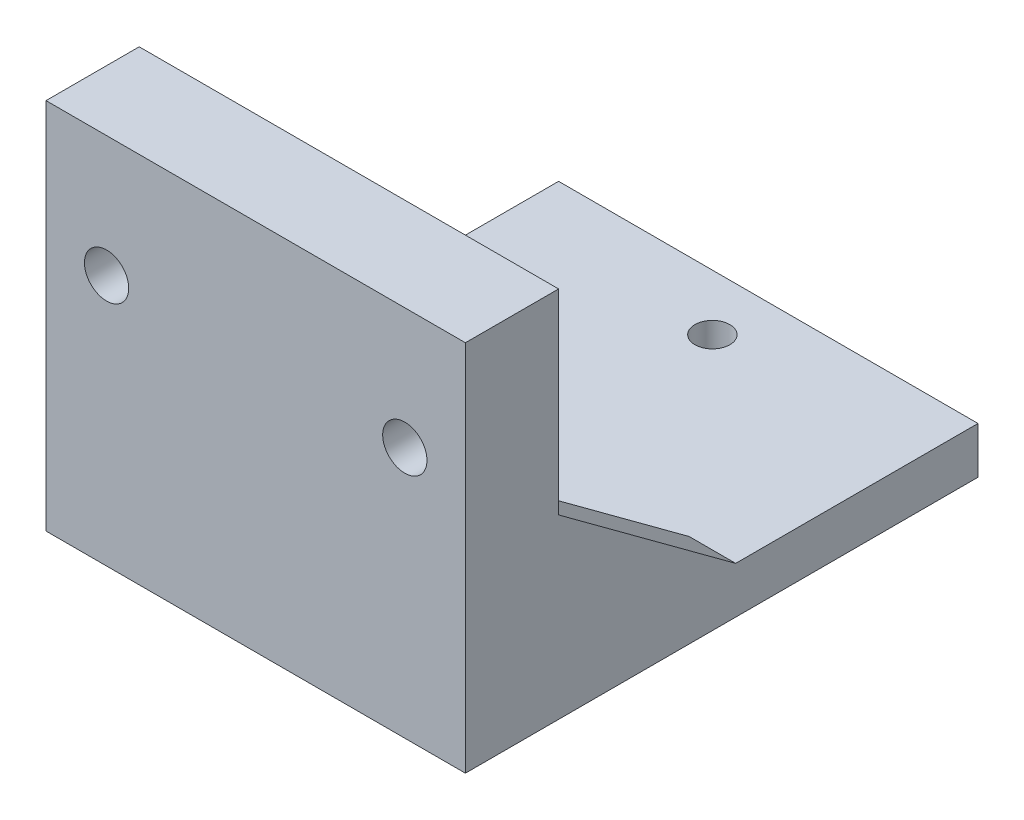
ISO-10303-21;
HEADER;
FILE_DESCRIPTION(('STEP AP214'),'2;1');
FILE_NAME('part.step','',(''),(''),'','','');
FILE_SCHEMA(('AUTOMOTIVE_DESIGN { 1 0 10303 214 1 1 1 1 }'));
ENDSEC;
DATA;
#1=APPLICATION_CONTEXT('core data for automotive mechanical design processes');
#2=APPLICATION_PROTOCOL_DEFINITION('international standard','automotive_design',2000,#1);
#3=PRODUCT_CONTEXT('',#1,'mechanical');
#4=PRODUCT('Part','Part','',(#3));
#5=PRODUCT_RELATED_PRODUCT_CATEGORY('part','',(#4));
#6=PRODUCT_DEFINITION_FORMATION('','',#4);
#7=PRODUCT_DEFINITION_CONTEXT('part definition',#1,'design');
#8=PRODUCT_DEFINITION('design','',#6,#7);
#9=PRODUCT_DEFINITION_SHAPE('','',#8);
#10=(LENGTH_UNIT() NAMED_UNIT(*) SI_UNIT(.MILLI.,.METRE.));
#11=(NAMED_UNIT(*) PLANE_ANGLE_UNIT() SI_UNIT($,.RADIAN.));
#12=(NAMED_UNIT(*) SI_UNIT($,.STERADIAN.) SOLID_ANGLE_UNIT());
#13=UNCERTAINTY_MEASURE_WITH_UNIT(LENGTH_MEASURE(1.E-05),#10,'distance_accuracy_value','');
#14=(GEOMETRIC_REPRESENTATION_CONTEXT(3) GLOBAL_UNCERTAINTY_ASSIGNED_CONTEXT((#13)) GLOBAL_UNIT_ASSIGNED_CONTEXT((#10,
#11,#12)) REPRESENTATION_CONTEXT('',''));
#15=CARTESIAN_POINT('',(0.,0.,0.));
#16=DIRECTION('',(0.,0.,1.));
#17=DIRECTION('',(1.,0.,0.));
#18=AXIS2_PLACEMENT_3D('',#15,#16,#17);
#19=CARTESIAN_POINT('',(0.,5.,0.));
#20=DIRECTION('',(0.,1.,0.));
#21=DIRECTION('',(0.,0.,1.));
#22=AXIS2_PLACEMENT_3D('',#19,#20,#21);
#23=PLANE('',#22);
#24=CARTESIAN_POINT('',(5.83193389236988,5.,101.550969125864));
#25=DIRECTION('',(0.,1.,0.));
#26=DIRECTION('',(0.,0.,1.));
#27=AXIS2_PLACEMENT_3D('',#24,#25,#26);
#28=CIRCLE('',#27,1.87500000000001);
#29=CARTESIAN_POINT('',(5.83193389236988,5.,103.425969125864));
#30=VERTEX_POINT('',#29);
#31=EDGE_CURVE('E231',#30,#30,#28,.T.);
#32=ORIENTED_EDGE('',*,*,#31,.F.);
#33=EDGE_LOOP('',(#32));
#34=FACE_BOUND('',#33,.T.);
#35=CARTESIAN_POINT('',(5.83193389236993,5.,136.550969125864));
#36=DIRECTION('',(0.,1.,0.));
#37=DIRECTION('',(0.,0.,1.));
#38=AXIS2_PLACEMENT_3D('',#35,#36,#37);
#39=CIRCLE('',#38,2.00000000000001);
#40=CARTESIAN_POINT('',(5.83193389236993,5.,138.550969125864));
#41=VERTEX_POINT('',#40);
#42=EDGE_CURVE('E234',#41,#41,#39,.T.);
#43=ORIENTED_EDGE('',*,*,#42,.F.);
#44=EDGE_LOOP('',(#43));
#45=FACE_BOUND('',#44,.T.);
#46=DIRECTION('',(0.,0.,1.));
#47=VECTOR('',#46,1.);
#48=CARTESIAN_POINT('',(23.3319338923699,5.,140.550969125864));
#49=LINE('',#48,#47);
#50=CARTESIAN_POINT('',(23.3319338923699,5.,121.550969125864));
#51=VERTEX_POINT('',#50);
#52=CARTESIAN_POINT('',(23.3319338923699,5.,140.550969125864));
#53=VERTEX_POINT('',#52);
#54=EDGE_CURVE('E54',#51,#53,#49,.T.);
#55=ORIENTED_EDGE('',*,*,#54,.F.);
#56=DIRECTION('',(1.,0.,0.));
#57=VECTOR('',#56,1.);
#58=CARTESIAN_POINT('',(23.3319338923699,5.,121.550969125864));
#59=LINE('',#58,#57);
#60=CARTESIAN_POINT('',(28.3319338923699,5.,121.550969125864));
#61=VERTEX_POINT('',#60);
#62=EDGE_CURVE('E59',#51,#61,#59,.T.);
#63=ORIENTED_EDGE('',*,*,#62,.T.);
#64=DIRECTION('',(0.,0.,1.));
#65=VECTOR('',#64,1.);
#66=CARTESIAN_POINT('',(28.3319338923699,5.,0.));
#67=LINE('',#66,#65);
#68=CARTESIAN_POINT('',(28.3319338923699,5.,95.550969125864));
#69=VERTEX_POINT('',#68);
#70=EDGE_CURVE('E245',#69,#61,#67,.T.);
#71=ORIENTED_EDGE('',*,*,#70,.F.);
#72=DIRECTION('',(-1.,0.,0.));
#73=VECTOR('',#72,1.);
#74=CARTESIAN_POINT('',(0.,5.,95.550969125864));
#75=LINE('',#74,#73);
#76=CARTESIAN_POINT('',(-16.6680661076301,5.,95.550969125864));
#77=VERTEX_POINT('',#76);
#78=EDGE_CURVE('E237',#69,#77,#75,.T.);
#79=ORIENTED_EDGE('',*,*,#78,.T.);
#80=DIRECTION('',(0.,0.,1.));
#81=VECTOR('',#80,1.);
#82=CARTESIAN_POINT('',(-16.6680661076301,5.,0.));
#83=LINE('',#82,#81);
#84=CARTESIAN_POINT('',(-16.6680661076301,5.,121.550969125864));
#85=VERTEX_POINT('',#84);
#86=EDGE_CURVE('E240',#77,#85,#83,.T.);
#87=ORIENTED_EDGE('',*,*,#86,.T.);
#88=DIRECTION('',(-1.,0.,0.));
#89=VECTOR('',#88,1.);
#90=CARTESIAN_POINT('',(-11.6680661076301,5.,121.550969125864));
#91=LINE('',#90,#89);
#92=CARTESIAN_POINT('',(-13.1927484764818,5.,121.550969125864));
#93=VERTEX_POINT('',#92);
#94=EDGE_CURVE('E208',#93,#85,#91,.T.);
#95=ORIENTED_EDGE('',*,*,#94,.F.);
#96=DIRECTION('',(0.,0.,-1.));
#97=VECTOR('',#96,1.);
#98=CARTESIAN_POINT('',(-13.1927484764818,5.,0.));
#99=LINE('',#98,#97);
#100=CARTESIAN_POINT('',(-13.1927484764818,5.,115.857981182173));
#101=VERTEX_POINT('',#100);
#102=EDGE_CURVE('E226',#93,#101,#99,.T.);
#103=ORIENTED_EDGE('',*,*,#102,.T.);
#104=DIRECTION('',(1.,0.,0.));
#105=VECTOR('',#104,1.);
#106=CARTESIAN_POINT('',(0.,5.,115.857981182173));
#107=LINE('',#106,#105);
#108=CARTESIAN_POINT('',(-11.1680661076301,5.,115.857981182173));
#109=VERTEX_POINT('',#108);
#110=EDGE_CURVE('E229',#101,#109,#107,.T.);
#111=ORIENTED_EDGE('',*,*,#110,.T.);
#112=DIRECTION('',(0.,0.,-1.));
#113=VECTOR('',#112,1.);
#114=CARTESIAN_POINT('',(-11.1680661076301,5.,0.));
#115=LINE('',#114,#113);
#116=CARTESIAN_POINT('',(-11.1680661076301,5.,122.243957069555));
#117=VERTEX_POINT('',#116);
#118=EDGE_CURVE('E218',#117,#109,#115,.T.);
#119=ORIENTED_EDGE('',*,*,#118,.F.);
#120=DIRECTION('',(1.,0.,0.));
#121=VECTOR('',#120,1.);
#122=CARTESIAN_POINT('',(0.,5.,122.243957069555));
#123=LINE('',#122,#121);
#124=CARTESIAN_POINT('',(-11.6680661076301,5.,122.243957069555));
#125=VERTEX_POINT('',#124);
#126=EDGE_CURVE('E221',#125,#117,#123,.T.);
#127=ORIENTED_EDGE('',*,*,#126,.F.);
#128=DIRECTION('',(0.,0.,1.));
#129=VECTOR('',#128,1.);
#130=CARTESIAN_POINT('',(-11.6680661076301,5.,140.550969125864));
#131=LINE('',#130,#129);
#132=CARTESIAN_POINT('',(-11.6680661076301,5.,140.550969125864));
#133=VERTEX_POINT('',#132);
#134=EDGE_CURVE('E197',#125,#133,#131,.T.);
#135=ORIENTED_EDGE('',*,*,#134,.T.);
#136=DIRECTION('',(-1.,0.,0.));
#137=VECTOR('',#136,1.);
#138=CARTESIAN_POINT('',(0.,5.,140.550969125864));
#139=LINE('',#138,#137);
#140=EDGE_CURVE('E243',#53,#133,#139,.T.);
#141=ORIENTED_EDGE('',*,*,#140,.F.);
#142=EDGE_LOOP('',(#55,#63,#71,#79,#87,#95,#103,#111,#119,#127,#135,#141));
#143=FACE_BOUND('',#142,.T.);
#144=ADVANCED_FACE('F37',(#34,#45,#143),#23,.T.);
#145=CARTESIAN_POINT('',(0.,40.,140.550969125864));
#146=DIRECTION('',(0.,0.,1.));
#147=DIRECTION('',(1.,0.,0.));
#148=AXIS2_PLACEMENT_3D('',#145,#146,#147);
#149=PLANE('',#148);
#150=CARTESIAN_POINT('',(-10.1680661076301,27.,140.550969125864));
#151=DIRECTION('',(0.,0.,1.));
#152=DIRECTION('',(1.,0.,0.));
#153=AXIS2_PLACEMENT_3D('',#150,#151,#152);
#154=CIRCLE('',#153,2.375);
#155=CARTESIAN_POINT('',(-7.79306610763013,27.,140.550969125864));
#156=VERTEX_POINT('',#155);
#157=EDGE_CURVE('E173',#156,#156,#154,.T.);
#158=ORIENTED_EDGE('',*,*,#157,.T.);
#159=EDGE_LOOP('',(#158));
#160=FACE_BOUND('',#159,.T.);
#161=CARTESIAN_POINT('',(21.8319338923699,27.,140.550969125864));
#162=DIRECTION('',(0.,0.,1.));
#163=DIRECTION('',(1.,0.,0.));
#164=AXIS2_PLACEMENT_3D('',#161,#162,#163);
#165=CIRCLE('',#164,2.375);
#166=CARTESIAN_POINT('',(24.2069338923699,27.,140.550969125864));
#167=VERTEX_POINT('',#166);
#168=EDGE_CURVE('E280',#167,#167,#165,.T.);
#169=ORIENTED_EDGE('',*,*,#168,.T.);
#170=EDGE_LOOP('',(#169));
#171=FACE_BOUND('',#170,.T.);
#172=DIRECTION('',(1.,0.,0.));
#173=VECTOR('',#172,1.);
#174=CARTESIAN_POINT('',(23.3319338923699,19.,140.550969125864));
#175=LINE('',#174,#173);
#176=CARTESIAN_POINT('',(23.3319338923699,19.,140.550969125864));
#177=VERTEX_POINT('',#176);
#178=CARTESIAN_POINT('',(28.3319338923699,19.,140.550969125864));
#179=VERTEX_POINT('',#178);
#180=EDGE_CURVE('E186',#177,#179,#175,.T.);
#181=ORIENTED_EDGE('',*,*,#180,.F.);
#182=DIRECTION('',(0.,1.,0.));
#183=VECTOR('',#182,1.);
#184=CARTESIAN_POINT('',(23.3319338923699,19.,140.550969125864));
#185=LINE('',#184,#183);
#186=EDGE_CURVE('E177',#53,#177,#185,.T.);
#187=ORIENTED_EDGE('',*,*,#186,.F.);
#188=ORIENTED_EDGE('',*,*,#140,.T.);
#189=DIRECTION('',(0.,1.,0.));
#190=VECTOR('',#189,1.);
#191=CARTESIAN_POINT('',(-11.6680661076301,19.,140.550969125864));
#192=LINE('',#191,#190);
#193=CARTESIAN_POINT('',(-11.6680661076301,19.,140.550969125864));
#194=VERTEX_POINT('',#193);
#195=EDGE_CURVE('E191',#133,#194,#192,.T.);
#196=ORIENTED_EDGE('',*,*,#195,.T.);
#197=DIRECTION('',(-1.,0.,0.));
#198=VECTOR('',#197,1.);
#199=CARTESIAN_POINT('',(-11.6680661076301,19.,140.550969125864));
#200=LINE('',#199,#198);
#201=CARTESIAN_POINT('',(-16.6680661076301,19.,140.550969125864));
#202=VERTEX_POINT('',#201);
#203=EDGE_CURVE('E201',#194,#202,#200,.T.);
#204=ORIENTED_EDGE('',*,*,#203,.T.);
#205=DIRECTION('',(0.,-1.,0.));
#206=VECTOR('',#205,1.);
#207=CARTESIAN_POINT('',(-16.6680661076301,40.,140.550969125864));
#208=LINE('',#207,#206);
#209=CARTESIAN_POINT('',(-16.6680661076301,40.,140.550969125864));
#210=VERTEX_POINT('',#209);
#211=EDGE_CURVE('E214',#210,#202,#208,.T.);
#212=ORIENTED_EDGE('',*,*,#211,.F.);
#213=DIRECTION('',(-1.,0.,0.));
#214=VECTOR('',#213,1.);
#215=CARTESIAN_POINT('',(0.,40.,140.550969125864));
#216=LINE('',#215,#214);
#217=CARTESIAN_POINT('',(28.3319338923699,40.,140.550969125864));
#218=VERTEX_POINT('',#217);
#219=EDGE_CURVE('E207',#218,#210,#216,.T.);
#220=ORIENTED_EDGE('',*,*,#219,.F.);
#221=DIRECTION('',(0.,-1.,0.));
#222=VECTOR('',#221,1.);
#223=CARTESIAN_POINT('',(28.3319338923699,40.,140.550969125864));
#224=LINE('',#223,#222);
#225=EDGE_CURVE('E155',#218,#179,#224,.T.);
#226=ORIENTED_EDGE('',*,*,#225,.T.);
#227=EDGE_LOOP('',(#181,#187,#188,#196,#204,#212,#220,#226));
#228=FACE_BOUND('',#227,.T.);
#229=ADVANCED_FACE('F317',(#160,#171,#228),#149,.F.);
#230=CARTESIAN_POINT('',(0.,5.,95.550969125864));
#231=DIRECTION('',(0.,0.,1.));
#232=DIRECTION('',(1.,0.,0.));
#233=AXIS2_PLACEMENT_3D('',#230,#231,#232);
#234=PLANE('',#233);
#235=DIRECTION('',(-1.,0.,0.));
#236=VECTOR('',#235,1.);
#237=CARTESIAN_POINT('',(0.,0.,95.550969125864));
#238=LINE('',#237,#236);
#239=CARTESIAN_POINT('',(28.3319338923699,0.,95.550969125864));
#240=VERTEX_POINT('',#239);
#241=CARTESIAN_POINT('',(-16.6680661076301,0.,95.550969125864));
#242=VERTEX_POINT('',#241);
#243=EDGE_CURVE('E264',#240,#242,#238,.T.);
#244=ORIENTED_EDGE('',*,*,#243,.T.);
#245=DIRECTION('',(0.,-1.,0.));
#246=VECTOR('',#245,1.);
#247=CARTESIAN_POINT('',(-16.6680661076301,5.,95.550969125864));
#248=LINE('',#247,#246);
#249=EDGE_CURVE('E11',#77,#242,#248,.T.);
#250=ORIENTED_EDGE('',*,*,#249,.F.);
#251=ORIENTED_EDGE('',*,*,#78,.F.);
#252=DIRECTION('',(0.,-1.,0.));
#253=VECTOR('',#252,1.);
#254=CARTESIAN_POINT('',(28.3319338923699,5.,95.550969125864));
#255=LINE('',#254,#253);
#256=EDGE_CURVE('E46',#69,#240,#255,.T.);
#257=ORIENTED_EDGE('',*,*,#256,.T.);
#258=EDGE_LOOP('',(#244,#250,#251,#257));
#259=FACE_BOUND('',#258,.T.);
#260=ADVANCED_FACE('F323',(#259),#234,.F.);
#261=CARTESIAN_POINT('',(-16.6680661076301,5.,0.));
#262=DIRECTION('',(1.,0.,0.));
#263=DIRECTION('',(0.,0.,-1.));
#264=AXIS2_PLACEMENT_3D('',#261,#262,#263);
#265=PLANE('',#264);
#266=DIRECTION('',(0.,0.,1.));
#267=VECTOR('',#266,1.);
#268=CARTESIAN_POINT('',(-16.6680661076301,0.,0.));
#269=LINE('',#268,#267);
#270=CARTESIAN_POINT('',(-16.6680661076301,0.,150.550969125864));
#271=VERTEX_POINT('',#270);
#272=EDGE_CURVE('E267',#242,#271,#269,.T.);
#273=ORIENTED_EDGE('',*,*,#272,.T.);
#274=DIRECTION('',(0.,-1.,0.));
#275=VECTOR('',#274,1.);
#276=CARTESIAN_POINT('',(-16.6680661076301,85.7055795281058,150.550969125864));
#277=LINE('',#276,#275);
#278=CARTESIAN_POINT('',(-16.6680661076301,40.,150.550969125864));
#279=VERTEX_POINT('',#278);
#280=EDGE_CURVE('E167',#279,#271,#277,.T.);
#281=ORIENTED_EDGE('',*,*,#280,.F.);
#282=DIRECTION('',(0.,0.,1.));
#283=VECTOR('',#282,1.);
#284=CARTESIAN_POINT('',(-16.6680661076301,40.,0.));
#285=LINE('',#284,#283);
#286=EDGE_CURVE('E159',#210,#279,#285,.T.);
#287=ORIENTED_EDGE('',*,*,#286,.F.);
#288=ORIENTED_EDGE('',*,*,#211,.T.);
#289=DIRECTION('',(0.,-0.59319903804985,-0.805055837353368));
#290=VECTOR('',#289,1.);
#291=CARTESIAN_POINT('',(-16.6680661076301,5.,121.550969125864));
#292=LINE('',#291,#290);
#293=EDGE_CURVE('E189',#202,#85,#292,.T.);
#294=ORIENTED_EDGE('',*,*,#293,.T.);
#295=ORIENTED_EDGE('',*,*,#86,.F.);
#296=ORIENTED_EDGE('',*,*,#249,.T.);
#297=EDGE_LOOP('',(#273,#281,#287,#288,#294,#295,#296));
#298=FACE_BOUND('',#297,.T.);
#299=ADVANCED_FACE('F336',(#298),#265,.F.);
#300=CARTESIAN_POINT('',(-11.1680661076301,5.,0.));
#301=DIRECTION('',(-1.,0.,0.));
#302=DIRECTION('',(0.,0.,1.));
#303=AXIS2_PLACEMENT_3D('',#300,#301,#302);
#304=PLANE('',#303);
#305=DIRECTION('',(0.,0.,-1.));
#306=VECTOR('',#305,1.);
#307=CARTESIAN_POINT('',(-11.1680661076301,0.,0.));
#308=LINE('',#307,#306);
#309=CARTESIAN_POINT('',(-11.1680661076301,0.,122.243957069555));
#310=VERTEX_POINT('',#309);
#311=CARTESIAN_POINT('',(-11.1680661076301,0.,115.857981182173));
#312=VERTEX_POINT('',#311);
#313=EDGE_CURVE('E217',#310,#312,#308,.T.);
#314=ORIENTED_EDGE('',*,*,#313,.F.);
#315=DIRECTION('',(0.,-1.,0.));
#316=VECTOR('',#315,1.);
#317=CARTESIAN_POINT('',(-11.1680661076301,5.,122.243957069555));
#318=LINE('',#317,#316);
#319=EDGE_CURVE('E270',#117,#310,#318,.T.);
#320=ORIENTED_EDGE('',*,*,#319,.F.);
#321=ORIENTED_EDGE('',*,*,#118,.T.);
#322=DIRECTION('',(0.,-1.,0.));
#323=VECTOR('',#322,1.);
#324=CARTESIAN_POINT('',(-11.1680661076301,5.,115.857981182173));
#325=LINE('',#324,#323);
#326=EDGE_CURVE('E247',#109,#312,#325,.T.);
#327=ORIENTED_EDGE('',*,*,#326,.T.);
#328=EDGE_LOOP('',(#314,#320,#321,#327));
#329=FACE_BOUND('',#328,.T.);
#330=ADVANCED_FACE('F39',(#329),#304,.T.);
#331=CARTESIAN_POINT('',(0.,5.,122.243957069555));
#332=DIRECTION('',(0.,0.,-1.));
#333=DIRECTION('',(-1.,0.,0.));
#334=AXIS2_PLACEMENT_3D('',#331,#332,#333);
#335=PLANE('',#334);
#336=DIRECTION('',(1.,0.,0.));
#337=VECTOR('',#336,1.);
#338=CARTESIAN_POINT('',(0.,0.,122.243957069555));
#339=LINE('',#338,#337);
#340=CARTESIAN_POINT('',(-13.1927484764818,0.,122.243957069555));
#341=VERTEX_POINT('',#340);
#342=EDGE_CURVE('E250',#341,#310,#339,.T.);
#343=ORIENTED_EDGE('',*,*,#342,.F.);
#344=DIRECTION('',(0.,-1.,0.));
#345=VECTOR('',#344,1.);
#346=CARTESIAN_POINT('',(-13.1927484764818,5.,122.243957069555));
#347=LINE('',#346,#345);
#348=CARTESIAN_POINT('',(-13.1927484764818,5.,122.243957069555));
#349=VERTEX_POINT('',#348);
#350=EDGE_CURVE('E276',#349,#341,#347,.T.);
#351=ORIENTED_EDGE('',*,*,#350,.F.);
#352=EDGE_CURVE('E223',#349,#125,#123,.T.);
#353=ORIENTED_EDGE('',*,*,#352,.T.);
#354=ORIENTED_EDGE('',*,*,#126,.T.);
#355=ORIENTED_EDGE('',*,*,#319,.T.);
#356=EDGE_LOOP('',(#343,#351,#353,#354,#355));
#357=FACE_BOUND('',#356,.T.);
#358=ADVANCED_FACE('F356',(#357),#335,.T.);
#359=CARTESIAN_POINT('',(-13.1927484764818,5.,0.));
#360=DIRECTION('',(-1.,0.,0.));
#361=DIRECTION('',(0.,0.,1.));
#362=AXIS2_PLACEMENT_3D('',#359,#360,#361);
#363=PLANE('',#362);
#364=DIRECTION('',(0.,0.,-1.));
#365=VECTOR('',#364,1.);
#366=CARTESIAN_POINT('',(-13.1927484764818,0.,0.));
#367=LINE('',#366,#365);
#368=CARTESIAN_POINT('',(-13.1927484764818,0.,115.857981182173));
#369=VERTEX_POINT('',#368);
#370=EDGE_CURVE('E253',#341,#369,#367,.T.);
#371=ORIENTED_EDGE('',*,*,#370,.T.);
#372=DIRECTION('',(0.,-1.,0.));
#373=VECTOR('',#372,1.);
#374=CARTESIAN_POINT('',(-13.1927484764818,5.,115.857981182173));
#375=LINE('',#374,#373);
#376=EDGE_CURVE('E273',#101,#369,#375,.T.);
#377=ORIENTED_EDGE('',*,*,#376,.F.);
#378=ORIENTED_EDGE('',*,*,#102,.F.);
#379=EDGE_CURVE('E227',#349,#93,#99,.T.);
#380=ORIENTED_EDGE('',*,*,#379,.F.);
#381=ORIENTED_EDGE('',*,*,#350,.T.);
#382=EDGE_LOOP('',(#371,#377,#378,#380,#381));
#383=FACE_BOUND('',#382,.T.);
#384=ADVANCED_FACE('F347',(#383),#363,.F.);
#385=CARTESIAN_POINT('',(5.83193389236993,5.,136.550969125864));
#386=DIRECTION('',(0.,-1.,0.));
#387=DIRECTION('',(0.,0.,-1.));
#388=AXIS2_PLACEMENT_3D('',#385,#386,#387);
#389=CYLINDRICAL_SURFACE('',#388,2.00000000000001);
#390=ORIENTED_EDGE('',*,*,#42,.T.);
#391=EDGE_LOOP('',(#390));
#392=FACE_BOUND('',#391,.T.);
#393=CARTESIAN_POINT('',(5.83193389236993,0.,136.550969125864));
#394=DIRECTION('',(0.,1.,0.));
#395=DIRECTION('',(0.,0.,1.));
#396=AXIS2_PLACEMENT_3D('',#393,#394,#395);
#397=CIRCLE('',#396,2.00000000000001);
#398=CARTESIAN_POINT('',(5.83193389236993,0.,138.550969125864));
#399=VERTEX_POINT('',#398);
#400=EDGE_CURVE('E261',#399,#399,#397,.T.);
#401=ORIENTED_EDGE('',*,*,#400,.F.);
#402=EDGE_LOOP('',(#401));
#403=FACE_BOUND('',#402,.T.);
#404=ADVANCED_FACE('F343',(#392,#403),#389,.F.);
#405=CARTESIAN_POINT('',(5.83193389236988,5.,101.550969125864));
#406=DIRECTION('',(0.,-1.,0.));
#407=DIRECTION('',(0.,0.,-1.));
#408=AXIS2_PLACEMENT_3D('',#405,#406,#407);
#409=CYLINDRICAL_SURFACE('',#408,1.87500000000001);
#410=ORIENTED_EDGE('',*,*,#31,.T.);
#411=EDGE_LOOP('',(#410));
#412=FACE_BOUND('',#411,.T.);
#413=CARTESIAN_POINT('',(5.83193389236988,0.,101.550969125864));
#414=DIRECTION('',(0.,1.,0.));
#415=DIRECTION('',(0.,0.,1.));
#416=AXIS2_PLACEMENT_3D('',#413,#414,#415);
#417=CIRCLE('',#416,1.87500000000001);
#418=CARTESIAN_POINT('',(5.83193389236988,0.,103.425969125864));
#419=VERTEX_POINT('',#418);
#420=EDGE_CURVE('E258',#419,#419,#417,.T.);
#421=ORIENTED_EDGE('',*,*,#420,.F.);
#422=EDGE_LOOP('',(#421));
#423=FACE_BOUND('',#422,.T.);
#424=ADVANCED_FACE('F346',(#412,#423),#409,.F.);
#425=CARTESIAN_POINT('',(0.,5.,115.857981182173));
#426=DIRECTION('',(0.,0.,-1.));
#427=DIRECTION('',(-1.,0.,0.));
#428=AXIS2_PLACEMENT_3D('',#425,#426,#427);
#429=PLANE('',#428);
#430=DIRECTION('',(1.,0.,0.));
#431=VECTOR('',#430,1.);
#432=CARTESIAN_POINT('',(0.,0.,115.857981182173));
#433=LINE('',#432,#431);
#434=EDGE_CURVE('E255',#369,#312,#433,.T.);
#435=ORIENTED_EDGE('',*,*,#434,.T.);
#436=ORIENTED_EDGE('',*,*,#326,.F.);
#437=ORIENTED_EDGE('',*,*,#110,.F.);
#438=ORIENTED_EDGE('',*,*,#376,.T.);
#439=EDGE_LOOP('',(#435,#436,#437,#438));
#440=FACE_BOUND('',#439,.T.);
#441=ADVANCED_FACE('F335',(#440),#429,.F.);
#442=CARTESIAN_POINT('',(28.3319338923699,5.,0.));
#443=DIRECTION('',(1.,0.,0.));
#444=DIRECTION('',(0.,0.,-1.));
#445=AXIS2_PLACEMENT_3D('',#442,#443,#444);
#446=PLANE('',#445);
#447=DIRECTION('',(0.,0.,1.));
#448=VECTOR('',#447,1.);
#449=CARTESIAN_POINT('',(28.3319338923699,0.,0.));
#450=LINE('',#449,#448);
#451=CARTESIAN_POINT('',(28.3319338923699,0.,150.550969125864));
#452=VERTEX_POINT('',#451);
#453=EDGE_CURVE('E222',#240,#452,#450,.T.);
#454=ORIENTED_EDGE('',*,*,#453,.F.);
#455=ORIENTED_EDGE('',*,*,#256,.F.);
#456=ORIENTED_EDGE('',*,*,#70,.T.);
#457=DIRECTION('',(0.,-0.59319903804985,-0.805055837353368));
#458=VECTOR('',#457,1.);
#459=CARTESIAN_POINT('',(28.3319338923699,5.,121.550969125864));
#460=LINE('',#459,#458);
#461=EDGE_CURVE('E180',#179,#61,#460,.T.);
#462=ORIENTED_EDGE('',*,*,#461,.F.);
#463=ORIENTED_EDGE('',*,*,#225,.F.);
#464=DIRECTION('',(0.,0.,1.));
#465=VECTOR('',#464,1.);
#466=CARTESIAN_POINT('',(28.3319338923699,40.,0.));
#467=LINE('',#466,#465);
#468=CARTESIAN_POINT('',(28.3319338923699,40.,150.550969125864));
#469=VERTEX_POINT('',#468);
#470=EDGE_CURVE('E147',#218,#469,#467,.T.);
#471=ORIENTED_EDGE('',*,*,#470,.T.);
#472=DIRECTION('',(0.,-1.,0.));
#473=VECTOR('',#472,1.);
#474=CARTESIAN_POINT('',(28.3319338923699,85.7055795281058,150.550969125864));
#475=LINE('',#474,#473);
#476=EDGE_CURVE('E152',#469,#452,#475,.T.);
#477=ORIENTED_EDGE('',*,*,#476,.T.);
#478=EDGE_LOOP('',(#454,#455,#456,#462,#463,#471,#477));
#479=FACE_BOUND('',#478,.T.);
#480=ADVANCED_FACE('F150',(#479),#446,.T.);
#481=CARTESIAN_POINT('',(0.,0.,0.));
#482=DIRECTION('',(0.,1.,0.));
#483=DIRECTION('',(0.,0.,1.));
#484=AXIS2_PLACEMENT_3D('',#481,#482,#483);
#485=PLANE('',#484);
#486=CARTESIAN_POINT('',(12.8319338923699,0.,119.050969125864));
#487=DIRECTION('',(0.,1.,0.));
#488=DIRECTION('',(0.,0.,1.));
#489=AXIS2_PLACEMENT_3D('',#486,#487,#488);
#490=CIRCLE('',#489,11.);
#491=CARTESIAN_POINT('',(12.8319338923699,0.,130.050969125864));
#492=VERTEX_POINT('',#491);
#493=EDGE_CURVE('E287',#492,#492,#490,.T.);
#494=ORIENTED_EDGE('',*,*,#493,.T.);
#495=EDGE_LOOP('',(#494));
#496=FACE_BOUND('',#495,.T.);
#497=ORIENTED_EDGE('',*,*,#313,.T.);
#498=ORIENTED_EDGE('',*,*,#434,.F.);
#499=ORIENTED_EDGE('',*,*,#370,.F.);
#500=ORIENTED_EDGE('',*,*,#342,.T.);
#501=EDGE_LOOP('',(#497,#498,#499,#500));
#502=FACE_BOUND('',#501,.T.);
#503=ORIENTED_EDGE('',*,*,#420,.T.);
#504=EDGE_LOOP('',(#503));
#505=FACE_BOUND('',#504,.T.);
#506=ORIENTED_EDGE('',*,*,#400,.T.);
#507=EDGE_LOOP('',(#506));
#508=FACE_BOUND('',#507,.T.);
#509=ORIENTED_EDGE('',*,*,#243,.F.);
#510=ORIENTED_EDGE('',*,*,#453,.T.);
#511=DIRECTION('',(-1.,0.,0.));
#512=VECTOR('',#511,1.);
#513=CARTESIAN_POINT('',(0.,0.,150.550969125864));
#514=LINE('',#513,#512);
#515=EDGE_CURVE('E171',#452,#271,#514,.T.);
#516=ORIENTED_EDGE('',*,*,#515,.T.);
#517=ORIENTED_EDGE('',*,*,#272,.F.);
#518=EDGE_LOOP('',(#509,#510,#516,#517));
#519=FACE_BOUND('',#518,.T.);
#520=ADVANCED_FACE('F329',(#496,#502,#505,#508,#519),#485,.F.);
#521=CARTESIAN_POINT('',(0.,40.,0.));
#522=DIRECTION('',(0.,1.,0.));
#523=DIRECTION('',(0.,0.,1.));
#524=AXIS2_PLACEMENT_3D('',#521,#522,#523);
#525=PLANE('',#524);
#526=ORIENTED_EDGE('',*,*,#219,.T.);
#527=ORIENTED_EDGE('',*,*,#286,.T.);
#528=DIRECTION('',(-1.,0.,0.));
#529=VECTOR('',#528,1.);
#530=CARTESIAN_POINT('',(0.,40.,150.550969125864));
#531=LINE('',#530,#529);
#532=EDGE_CURVE('E162',#469,#279,#531,.T.);
#533=ORIENTED_EDGE('',*,*,#532,.F.);
#534=ORIENTED_EDGE('',*,*,#470,.F.);
#535=EDGE_LOOP('',(#526,#527,#533,#534));
#536=FACE_BOUND('',#535,.T.);
#537=ADVANCED_FACE('F163',(#536),#525,.T.);
#538=CARTESIAN_POINT('',(-11.6680661076301,5.,140.550969125864));
#539=DIRECTION('',(0.,-1.,0.));
#540=DIRECTION('',(0.,0.,-1.));
#541=AXIS2_PLACEMENT_3D('',#538,#539,#540);
#542=PLANE('',#541);
#543=CARTESIAN_POINT('',(-11.6680661076301,5.,121.550969125864));
#544=VERTEX_POINT('',#543);
#545=EDGE_CURVE('E198',#544,#125,#131,.T.);
#546=ORIENTED_EDGE('',*,*,#545,.T.);
#547=ORIENTED_EDGE('',*,*,#352,.F.);
#548=ORIENTED_EDGE('',*,*,#379,.T.);
#549=EDGE_CURVE('E204',#544,#93,#91,.T.);
#550=ORIENTED_EDGE('',*,*,#549,.F.);
#551=EDGE_LOOP('',(#546,#547,#548,#550));
#552=FACE_BOUND('',#551,.T.);
#553=ADVANCED_FACE('F381',(#552),#542,.T.);
#554=CARTESIAN_POINT('',(-11.6680661076301,5.,121.550969125864));
#555=DIRECTION('',(0.,0.805055837353368,-0.59319903804985));
#556=DIRECTION('',(0.,0.59319903804985,0.805055837353368));
#557=AXIS2_PLACEMENT_3D('',#554,#555,#556);
#558=PLANE('',#557);
#559=ORIENTED_EDGE('',*,*,#293,.F.);
#560=ORIENTED_EDGE('',*,*,#203,.F.);
#561=DIRECTION('',(0.,-0.59319903804985,-0.805055837353368));
#562=VECTOR('',#561,1.);
#563=CARTESIAN_POINT('',(-11.6680661076301,5.,121.550969125864));
#564=LINE('',#563,#562);
#565=EDGE_CURVE('E194',#194,#544,#564,.T.);
#566=ORIENTED_EDGE('',*,*,#565,.T.);
#567=ORIENTED_EDGE('',*,*,#549,.T.);
#568=ORIENTED_EDGE('',*,*,#94,.T.);
#569=EDGE_LOOP('',(#559,#560,#566,#567,#568));
#570=FACE_BOUND('',#569,.T.);
#571=ADVANCED_FACE('F384',(#570),#558,.T.);
#572=CARTESIAN_POINT('',(-11.6680661076301,0.,0.));
#573=DIRECTION('',(1.,0.,0.));
#574=DIRECTION('',(0.,0.,-1.));
#575=AXIS2_PLACEMENT_3D('',#572,#573,#574);
#576=PLANE('',#575);
#577=ORIENTED_EDGE('',*,*,#195,.F.);
#578=ORIENTED_EDGE('',*,*,#134,.F.);
#579=ORIENTED_EDGE('',*,*,#545,.F.);
#580=ORIENTED_EDGE('',*,*,#565,.F.);
#581=EDGE_LOOP('',(#577,#578,#579,#580));
#582=FACE_BOUND('',#581,.T.);
#583=ADVANCED_FACE('F388',(#582),#576,.T.);
#584=CARTESIAN_POINT('',(23.3319338923699,5.,121.550969125864));
#585=DIRECTION('',(0.,-0.805055837353368,0.59319903804985));
#586=DIRECTION('',(0.,-0.59319903804985,-0.805055837353368));
#587=AXIS2_PLACEMENT_3D('',#584,#585,#586);
#588=PLANE('',#587);
#589=ORIENTED_EDGE('',*,*,#461,.T.);
#590=ORIENTED_EDGE('',*,*,#62,.F.);
#591=DIRECTION('',(0.,-0.59319903804985,-0.805055837353368));
#592=VECTOR('',#591,1.);
#593=CARTESIAN_POINT('',(23.3319338923699,5.,121.550969125864));
#594=LINE('',#593,#592);
#595=EDGE_CURVE('E182',#177,#51,#594,.T.);
#596=ORIENTED_EDGE('',*,*,#595,.F.);
#597=ORIENTED_EDGE('',*,*,#180,.T.);
#598=EDGE_LOOP('',(#589,#590,#596,#597));
#599=FACE_BOUND('',#598,.T.);
#600=ADVANCED_FACE('F313',(#599),#588,.F.);
#601=CARTESIAN_POINT('',(23.3319338923699,0.,0.));
#602=DIRECTION('',(-1.,0.,0.));
#603=DIRECTION('',(0.,0.,-1.));
#604=AXIS2_PLACEMENT_3D('',#601,#602,#603);
#605=PLANE('',#604);
#606=ORIENTED_EDGE('',*,*,#186,.T.);
#607=ORIENTED_EDGE('',*,*,#595,.T.);
#608=ORIENTED_EDGE('',*,*,#54,.T.);
#609=EDGE_LOOP('',(#606,#607,#608));
#610=FACE_BOUND('',#609,.T.);
#611=ADVANCED_FACE('F306',(#610),#605,.T.);
#612=CARTESIAN_POINT('',(0.,85.7055795281058,150.550969125864));
#613=DIRECTION('',(0.,0.,1.));
#614=DIRECTION('',(1.,0.,0.));
#615=AXIS2_PLACEMENT_3D('',#612,#613,#614);
#616=PLANE('',#615);
#617=CARTESIAN_POINT('',(-10.1680661076301,27.,150.550969125864));
#618=DIRECTION('',(0.,0.,1.));
#619=DIRECTION('',(1.,0.,0.));
#620=AXIS2_PLACEMENT_3D('',#617,#618,#619);
#621=CIRCLE('',#620,2.375);
#622=CARTESIAN_POINT('',(-7.79306610763013,27.,150.550969125864));
#623=VERTEX_POINT('',#622);
#624=EDGE_CURVE('E41',#623,#623,#621,.T.);
#625=ORIENTED_EDGE('',*,*,#624,.F.);
#626=EDGE_LOOP('',(#625));
#627=FACE_BOUND('',#626,.T.);
#628=CARTESIAN_POINT('',(21.8319338923699,27.,150.550969125864));
#629=DIRECTION('',(0.,0.,1.));
#630=DIRECTION('',(1.,0.,0.));
#631=AXIS2_PLACEMENT_3D('',#628,#629,#630);
#632=CIRCLE('',#631,2.375);
#633=CARTESIAN_POINT('',(24.2069338923699,27.,150.550969125864));
#634=VERTEX_POINT('',#633);
#635=EDGE_CURVE('E278',#634,#634,#632,.T.);
#636=ORIENTED_EDGE('',*,*,#635,.F.);
#637=EDGE_LOOP('',(#636));
#638=FACE_BOUND('',#637,.T.);
#639=ORIENTED_EDGE('',*,*,#476,.F.);
#640=ORIENTED_EDGE('',*,*,#532,.T.);
#641=ORIENTED_EDGE('',*,*,#280,.T.);
#642=ORIENTED_EDGE('',*,*,#515,.F.);
#643=EDGE_LOOP('',(#639,#640,#641,#642));
#644=FACE_BOUND('',#643,.T.);
#645=ADVANCED_FACE('F169',(#627,#638,#644),#616,.T.);
#646=CARTESIAN_POINT('',(21.8319338923699,27.,95.550969125864));
#647=DIRECTION('',(0.,0.,1.));
#648=DIRECTION('',(1.,0.,0.));
#649=AXIS2_PLACEMENT_3D('',#646,#647,#648);
#650=CYLINDRICAL_SURFACE('',#649,2.375);
#651=ORIENTED_EDGE('',*,*,#635,.T.);
#652=EDGE_LOOP('',(#651));
#653=FACE_BOUND('',#652,.T.);
#654=ORIENTED_EDGE('',*,*,#168,.F.);
#655=EDGE_LOOP('',(#654));
#656=FACE_BOUND('',#655,.T.);
#657=ADVANCED_FACE('F305',(#653,#656),#650,.F.);
#658=CARTESIAN_POINT('',(-10.1680661076301,27.,95.550969125864));
#659=DIRECTION('',(0.,0.,1.));
#660=DIRECTION('',(1.,0.,0.));
#661=AXIS2_PLACEMENT_3D('',#658,#659,#660);
#662=CYLINDRICAL_SURFACE('',#661,2.375);
#663=ORIENTED_EDGE('',*,*,#624,.T.);
#664=EDGE_LOOP('',(#663));
#665=FACE_BOUND('',#664,.T.);
#666=ORIENTED_EDGE('',*,*,#157,.F.);
#667=EDGE_LOOP('',(#666));
#668=FACE_BOUND('',#667,.T.);
#669=ADVANCED_FACE('F300',(#665,#668),#662,.F.);
#670=CARTESIAN_POINT('',(12.8319338923699,1.,119.050969125864));
#671=DIRECTION('',(0.,-1.,0.));
#672=DIRECTION('',(0.,0.,-1.));
#673=AXIS2_PLACEMENT_3D('',#670,#671,#672);
#674=CYLINDRICAL_SURFACE('',#673,11.);
#675=CARTESIAN_POINT('',(12.8319338923699,1.,119.050969125864));
#676=DIRECTION('',(0.,1.,0.));
#677=DIRECTION('',(0.,0.,1.));
#678=AXIS2_PLACEMENT_3D('',#675,#676,#677);
#679=CIRCLE('',#678,11.);
#680=CARTESIAN_POINT('',(12.8319338923699,1.,130.050969125864));
#681=VERTEX_POINT('',#680);
#682=EDGE_CURVE('E281',#681,#681,#679,.T.);
#683=ORIENTED_EDGE('',*,*,#682,.T.);
#684=EDGE_LOOP('',(#683));
#685=FACE_BOUND('',#684,.T.);
#686=ORIENTED_EDGE('',*,*,#493,.F.);
#687=EDGE_LOOP('',(#686));
#688=FACE_BOUND('',#687,.T.);
#689=ADVANCED_FACE('F520',(#685,#688),#674,.F.);
#690=CARTESIAN_POINT('',(12.8319338923699,1.,119.050969125864));
#691=DIRECTION('',(0.,1.,0.));
#692=DIRECTION('',(0.,0.,1.));
#693=AXIS2_PLACEMENT_3D('',#690,#691,#692);
#694=PLANE('',#693);
#695=ORIENTED_EDGE('',*,*,#682,.F.);
#696=EDGE_LOOP('',(#695));
#697=FACE_BOUND('',#696,.T.);
#698=ADVANCED_FACE('F534',(#697),#694,.F.);
#699=CLOSED_SHELL('',(#144,#229,#260,#299,#330,#358,#384,#404,#424,#441,#480,#520,#537,#553,
#571,#583,#600,#611,#645,#657,#669,#689,#698));
#700=MANIFOLD_SOLID_BREP('B2',#699);
#701=ADVANCED_BREP_SHAPE_REPRESENTATION('',(#18,#700),#14);
#702=SHAPE_DEFINITION_REPRESENTATION(#9,#701);
ENDSEC;
END-ISO-10303-21;
